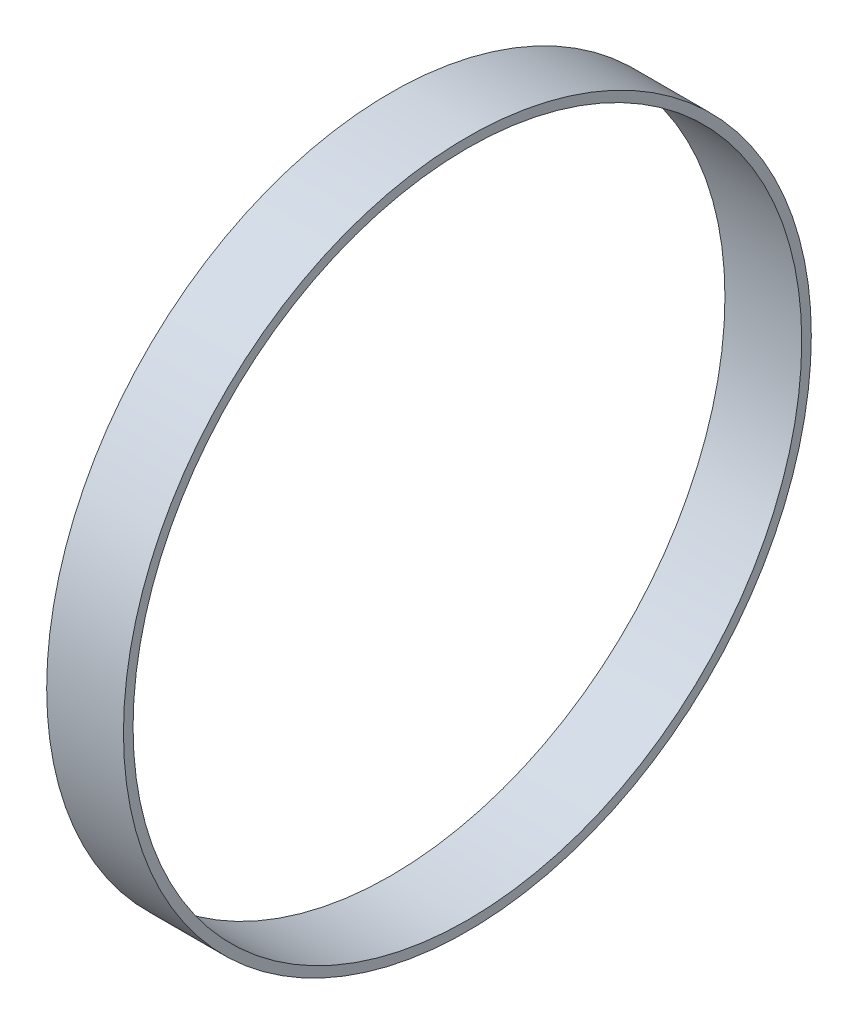
ISO-10303-21;
HEADER;
FILE_DESCRIPTION(('STEP AP214'),'2;1');
FILE_NAME('part.step','',(''),(''),'','','');
FILE_SCHEMA(('AUTOMOTIVE_DESIGN { 1 0 10303 214 1 1 1 1 }'));
ENDSEC;
DATA;
#1=APPLICATION_CONTEXT('core data for automotive mechanical design processes');
#2=APPLICATION_PROTOCOL_DEFINITION('international standard','automotive_design',2000,#1);
#3=PRODUCT_CONTEXT('',#1,'mechanical');
#4=PRODUCT('Part','Part','',(#3));
#5=PRODUCT_RELATED_PRODUCT_CATEGORY('part','',(#4));
#6=PRODUCT_DEFINITION_FORMATION('','',#4);
#7=PRODUCT_DEFINITION_CONTEXT('part definition',#1,'design');
#8=PRODUCT_DEFINITION('design','',#6,#7);
#9=PRODUCT_DEFINITION_SHAPE('','',#8);
#10=(LENGTH_UNIT() NAMED_UNIT(*) SI_UNIT(.MILLI.,.METRE.));
#11=(NAMED_UNIT(*) PLANE_ANGLE_UNIT() SI_UNIT($,.RADIAN.));
#12=(NAMED_UNIT(*) SI_UNIT($,.STERADIAN.) SOLID_ANGLE_UNIT());
#13=UNCERTAINTY_MEASURE_WITH_UNIT(LENGTH_MEASURE(1.E-05),#10,'distance_accuracy_value','');
#14=(GEOMETRIC_REPRESENTATION_CONTEXT(3) GLOBAL_UNCERTAINTY_ASSIGNED_CONTEXT((#13)) GLOBAL_UNIT_ASSIGNED_CONTEXT((#10,
#11,#12)) REPRESENTATION_CONTEXT('',''));
#15=CARTESIAN_POINT('',(0.,0.,0.));
#16=DIRECTION('',(0.,0.,1.));
#17=DIRECTION('',(1.,0.,0.));
#18=AXIS2_PLACEMENT_3D('',#15,#16,#17);
#19=CARTESIAN_POINT('',(0.,107.5,0.));
#20=DIRECTION('',(1.,0.,0.));
#21=DIRECTION('',(0.,0.,-1.));
#22=AXIS2_PLACEMENT_3D('',#19,#20,#21);
#23=PLANE('',#22);
#24=CARTESIAN_POINT('',(0.,0.,0.));
#25=DIRECTION('',(1.,0.,0.));
#26=DIRECTION('',(0.,0.,-1.));
#27=AXIS2_PLACEMENT_3D('',#24,#25,#26);
#28=CIRCLE('',#27,107.5);
#29=CARTESIAN_POINT('',(0.,0.,-107.5));
#30=VERTEX_POINT('',#29);
#31=EDGE_CURVE('E58',#30,#30,#28,.T.);
#32=ORIENTED_EDGE('',*,*,#31,.T.);
#33=EDGE_LOOP('',(#32));
#34=FACE_BOUND('',#33,.T.);
#35=CARTESIAN_POINT('',(0.,0.,0.));
#36=DIRECTION('',(1.,0.,0.));
#37=DIRECTION('',(0.,0.,-1.));
#38=AXIS2_PLACEMENT_3D('',#35,#36,#37);
#39=CIRCLE('',#38,104.5);
#40=CARTESIAN_POINT('',(0.,0.,-104.5));
#41=VERTEX_POINT('',#40);
#42=EDGE_CURVE('E12',#41,#41,#39,.T.);
#43=ORIENTED_EDGE('',*,*,#42,.F.);
#44=EDGE_LOOP('',(#43));
#45=FACE_BOUND('',#44,.T.);
#46=ADVANCED_FACE('F44',(#34,#45),#23,.T.);
#47=CARTESIAN_POINT('',(0.,0.,0.));
#48=DIRECTION('',(1.,0.,0.));
#49=DIRECTION('',(0.,0.,-1.));
#50=AXIS2_PLACEMENT_3D('',#47,#48,#49);
#51=CYLINDRICAL_SURFACE('',#50,104.5);
#52=ORIENTED_EDGE('',*,*,#42,.T.);
#53=EDGE_LOOP('',(#52));
#54=FACE_BOUND('',#53,.T.);
#55=CARTESIAN_POINT('',(-24.,0.,0.));
#56=DIRECTION('',(1.,0.,0.));
#57=DIRECTION('',(0.,0.,-1.));
#58=AXIS2_PLACEMENT_3D('',#55,#56,#57);
#59=CIRCLE('',#58,104.5);
#60=CARTESIAN_POINT('',(-24.,0.,-104.5));
#61=VERTEX_POINT('',#60);
#62=EDGE_CURVE('E50',#61,#61,#59,.T.);
#63=ORIENTED_EDGE('',*,*,#62,.F.);
#64=EDGE_LOOP('',(#63));
#65=FACE_BOUND('',#64,.T.);
#66=ADVANCED_FACE('F74',(#54,#65),#51,.F.);
#67=CARTESIAN_POINT('',(-24.,107.5,0.));
#68=DIRECTION('',(-1.,0.,0.));
#69=DIRECTION('',(0.,0.,1.));
#70=AXIS2_PLACEMENT_3D('',#67,#68,#69);
#71=PLANE('',#70);
#72=ORIENTED_EDGE('',*,*,#62,.T.);
#73=EDGE_LOOP('',(#72));
#74=FACE_BOUND('',#73,.T.);
#75=CARTESIAN_POINT('',(-24.,0.,0.));
#76=DIRECTION('',(1.,0.,0.));
#77=DIRECTION('',(0.,0.,-1.));
#78=AXIS2_PLACEMENT_3D('',#75,#76,#77);
#79=CIRCLE('',#78,107.5);
#80=CARTESIAN_POINT('',(-24.,0.,-107.5));
#81=VERTEX_POINT('',#80);
#82=EDGE_CURVE('E54',#81,#81,#79,.T.);
#83=ORIENTED_EDGE('',*,*,#82,.F.);
#84=EDGE_LOOP('',(#83));
#85=FACE_BOUND('',#84,.T.);
#86=ADVANCED_FACE('F68',(#74,#85),#71,.T.);
#87=CARTESIAN_POINT('',(0.,0.,0.));
#88=DIRECTION('',(1.,0.,0.));
#89=DIRECTION('',(0.,0.,-1.));
#90=AXIS2_PLACEMENT_3D('',#87,#88,#89);
#91=CYLINDRICAL_SURFACE('',#90,107.5);
#92=ORIENTED_EDGE('',*,*,#82,.T.);
#93=EDGE_LOOP('',(#92));
#94=FACE_BOUND('',#93,.T.);
#95=ORIENTED_EDGE('',*,*,#31,.F.);
#96=EDGE_LOOP('',(#95));
#97=FACE_BOUND('',#96,.T.);
#98=ADVANCED_FACE('F66',(#94,#97),#91,.T.);
#99=CLOSED_SHELL('',(#46,#66,#86,#98));
#100=MANIFOLD_SOLID_BREP('B2',#99);
#101=ADVANCED_BREP_SHAPE_REPRESENTATION('',(#18,#100),#14);
#102=SHAPE_DEFINITION_REPRESENTATION(#9,#101);
ENDSEC;
END-ISO-10303-21;
